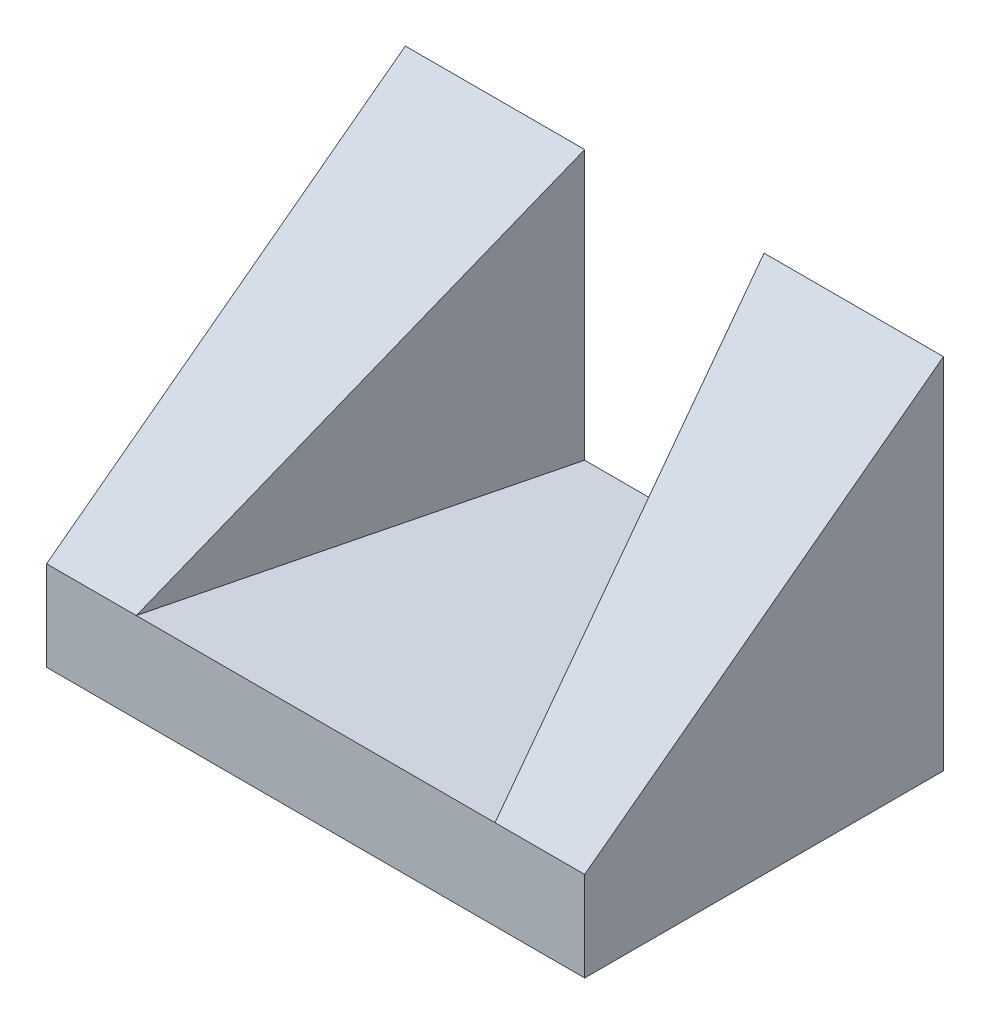
ISO-10303-21;
HEADER;
FILE_DESCRIPTION(('STEP AP214'),'2;1');
FILE_NAME('part.step','',(''),(''),'','','');
FILE_SCHEMA(('AUTOMOTIVE_DESIGN { 1 0 10303 214 1 1 1 1 }'));
ENDSEC;
DATA;
#1=APPLICATION_CONTEXT('core data for automotive mechanical design processes');
#2=APPLICATION_PROTOCOL_DEFINITION('international standard','automotive_design',2000,#1);
#3=PRODUCT_CONTEXT('',#1,'mechanical');
#4=PRODUCT('Part','Part','',(#3));
#5=PRODUCT_RELATED_PRODUCT_CATEGORY('part','',(#4));
#6=PRODUCT_DEFINITION_FORMATION('','',#4);
#7=PRODUCT_DEFINITION_CONTEXT('part definition',#1,'design');
#8=PRODUCT_DEFINITION('design','',#6,#7);
#9=PRODUCT_DEFINITION_SHAPE('','',#8);
#10=(LENGTH_UNIT() NAMED_UNIT(*) SI_UNIT(.MILLI.,.METRE.));
#11=(NAMED_UNIT(*) PLANE_ANGLE_UNIT() SI_UNIT($,.RADIAN.));
#12=(NAMED_UNIT(*) SI_UNIT($,.STERADIAN.) SOLID_ANGLE_UNIT());
#13=UNCERTAINTY_MEASURE_WITH_UNIT(LENGTH_MEASURE(1.E-05),#10,'distance_accuracy_value','');
#14=(GEOMETRIC_REPRESENTATION_CONTEXT(3) GLOBAL_UNCERTAINTY_ASSIGNED_CONTEXT((#13)) GLOBAL_UNIT_ASSIGNED_CONTEXT((#10,
#11,#12)) REPRESENTATION_CONTEXT('',''));
#15=CARTESIAN_POINT('',(0.,0.,0.));
#16=DIRECTION('',(0.,0.,1.));
#17=DIRECTION('',(1.,0.,0.));
#18=AXIS2_PLACEMENT_3D('',#15,#16,#17);
#19=CARTESIAN_POINT('',(0.,10.,0.));
#20=DIRECTION('',(1.,0.,0.));
#21=DIRECTION('',(0.,0.,-1.));
#22=AXIS2_PLACEMENT_3D('',#19,#20,#21);
#23=PLANE('',#22);
#24=DIRECTION('',(0.,-0.6,0.8));
#25=VECTOR('',#24,1.);
#26=CARTESIAN_POINT('',(0.,10.,0.));
#27=LINE('',#26,#25);
#28=CARTESIAN_POINT('',(0.,40.,-40.));
#29=VERTEX_POINT('',#28);
#30=CARTESIAN_POINT('',(0.,10.,0.));
#31=VERTEX_POINT('',#30);
#32=EDGE_CURVE('E116',#29,#31,#27,.T.);
#33=ORIENTED_EDGE('',*,*,#32,.F.);
#34=DIRECTION('',(0.,-1.,0.));
#35=VECTOR('',#34,1.);
#36=CARTESIAN_POINT('',(0.,10.,-40.));
#37=LINE('',#36,#35);
#38=CARTESIAN_POINT('',(0.,0.,-40.));
#39=VERTEX_POINT('',#38);
#40=EDGE_CURVE('E125',#29,#39,#37,.T.);
#41=ORIENTED_EDGE('',*,*,#40,.T.);
#42=DIRECTION('',(0.,0.,1.));
#43=VECTOR('',#42,1.);
#44=CARTESIAN_POINT('',(0.,0.,0.));
#45=LINE('',#44,#43);
#46=CARTESIAN_POINT('',(0.,0.,0.));
#47=VERTEX_POINT('',#46);
#48=EDGE_CURVE('E138',#39,#47,#45,.T.);
#49=ORIENTED_EDGE('',*,*,#48,.T.);
#50=DIRECTION('',(0.,-1.,0.));
#51=VECTOR('',#50,1.);
#52=CARTESIAN_POINT('',(0.,10.,0.));
#53=LINE('',#52,#51);
#54=EDGE_CURVE('E11',#31,#47,#53,.T.);
#55=ORIENTED_EDGE('',*,*,#54,.F.);
#56=EDGE_LOOP('',(#33,#41,#49,#55));
#57=FACE_BOUND('',#56,.T.);
#58=ADVANCED_FACE('F39',(#57),#23,.F.);
#59=CARTESIAN_POINT('',(0.,10.,0.));
#60=DIRECTION('',(0.,0.,-1.));
#61=DIRECTION('',(-1.,0.,0.));
#62=AXIS2_PLACEMENT_3D('',#59,#60,#61);
#63=PLANE('',#62);
#64=DIRECTION('',(-1.,0.,0.));
#65=VECTOR('',#64,1.);
#66=CARTESIAN_POINT('',(69.,10.,0.));
#67=LINE('',#66,#65);
#68=CARTESIAN_POINT('',(10.,10.,0.));
#69=VERTEX_POINT('',#68);
#70=EDGE_CURVE('E109',#69,#31,#67,.T.);
#71=ORIENTED_EDGE('',*,*,#70,.T.);
#72=ORIENTED_EDGE('',*,*,#54,.T.);
#73=DIRECTION('',(1.,0.,0.));
#74=VECTOR('',#73,1.);
#75=CARTESIAN_POINT('',(0.,0.,0.));
#76=LINE('',#75,#74);
#77=CARTESIAN_POINT('',(60.,0.,0.));
#78=VERTEX_POINT('',#77);
#79=EDGE_CURVE('E122',#47,#78,#76,.T.);
#80=ORIENTED_EDGE('',*,*,#79,.T.);
#81=DIRECTION('',(0.,-1.,0.));
#82=VECTOR('',#81,1.);
#83=CARTESIAN_POINT('',(60.,10.,0.));
#84=LINE('',#83,#82);
#85=CARTESIAN_POINT('',(60.,10.,0.));
#86=VERTEX_POINT('',#85);
#87=EDGE_CURVE('E47',#86,#78,#84,.T.);
#88=ORIENTED_EDGE('',*,*,#87,.F.);
#89=CARTESIAN_POINT('',(50.,10.,0.));
#90=VERTEX_POINT('',#89);
#91=EDGE_CURVE('E98',#86,#90,#67,.T.);
#92=ORIENTED_EDGE('',*,*,#91,.T.);
#93=DIRECTION('',(1.,0.,0.));
#94=VECTOR('',#93,1.);
#95=CARTESIAN_POINT('',(0.,10.,0.));
#96=LINE('',#95,#94);
#97=EDGE_CURVE('E133',#69,#90,#96,.T.);
#98=ORIENTED_EDGE('',*,*,#97,.F.);
#99=EDGE_LOOP('',(#71,#72,#80,#88,#92,#98));
#100=FACE_BOUND('',#99,.T.);
#101=ADVANCED_FACE('F120',(#100),#63,.F.);
#102=CARTESIAN_POINT('',(60.,10.,0.));
#103=DIRECTION('',(-1.,0.,0.));
#104=DIRECTION('',(0.,0.,1.));
#105=AXIS2_PLACEMENT_3D('',#102,#103,#104);
#106=PLANE('',#105);
#107=DIRECTION('',(0.,0.6,-0.8));
#108=VECTOR('',#107,1.);
#109=CARTESIAN_POINT('',(60.,10.,0.));
#110=LINE('',#109,#108);
#111=CARTESIAN_POINT('',(60.,40.,-40.));
#112=VERTEX_POINT('',#111);
#113=EDGE_CURVE('E101',#86,#112,#110,.T.);
#114=ORIENTED_EDGE('',*,*,#113,.F.);
#115=ORIENTED_EDGE('',*,*,#87,.T.);
#116=DIRECTION('',(0.,0.,-1.));
#117=VECTOR('',#116,1.);
#118=CARTESIAN_POINT('',(60.,0.,0.));
#119=LINE('',#118,#117);
#120=CARTESIAN_POINT('',(60.,0.,-40.));
#121=VERTEX_POINT('',#120);
#122=EDGE_CURVE('E62',#78,#121,#119,.T.);
#123=ORIENTED_EDGE('',*,*,#122,.T.);
#124=DIRECTION('',(0.,-1.,0.));
#125=VECTOR('',#124,1.);
#126=CARTESIAN_POINT('',(60.,10.,-40.));
#127=LINE('',#126,#125);
#128=EDGE_CURVE('E113',#112,#121,#127,.T.);
#129=ORIENTED_EDGE('',*,*,#128,.F.);
#130=EDGE_LOOP('',(#114,#115,#123,#129));
#131=FACE_BOUND('',#130,.T.);
#132=ADVANCED_FACE('F111',(#131),#106,.F.);
#133=CARTESIAN_POINT('',(20.,40.,-40.));
#134=DIRECTION('',(-0.970142500145332,0.,-0.242535625036333));
#135=DIRECTION('',(-0.242535625036333,0.,0.970142500145332));
#136=AXIS2_PLACEMENT_3D('',#133,#134,#135);
#137=PLANE('',#136);
#138=DIRECTION('',(0.196116135138184,0.588348405414552,-0.784464540552736));
#139=VECTOR('',#138,1.);
#140=CARTESIAN_POINT('',(20.,40.,-40.));
#141=LINE('',#140,#139);
#142=CARTESIAN_POINT('',(20.,40.,-40.));
#143=VERTEX_POINT('',#142);
#144=EDGE_CURVE('E117',#69,#143,#141,.T.);
#145=ORIENTED_EDGE('',*,*,#144,.F.);
#146=DIRECTION('',(0.242535625036333,0.,-0.970142500145332));
#147=VECTOR('',#146,1.);
#148=CARTESIAN_POINT('',(20.,10.,-40.));
#149=LINE('',#148,#147);
#150=CARTESIAN_POINT('',(20.,10.,-40.));
#151=VERTEX_POINT('',#150);
#152=EDGE_CURVE('E151',#69,#151,#149,.T.);
#153=ORIENTED_EDGE('',*,*,#152,.T.);
#154=DIRECTION('',(0.,-1.,0.));
#155=VECTOR('',#154,1.);
#156=CARTESIAN_POINT('',(20.,40.,-40.));
#157=LINE('',#156,#155);
#158=EDGE_CURVE('E142',#143,#151,#157,.T.);
#159=ORIENTED_EDGE('',*,*,#158,.F.);
#160=EDGE_LOOP('',(#145,#153,#159));
#161=FACE_BOUND('',#160,.T.);
#162=ADVANCED_FACE('F201',(#161),#137,.F.);
#163=CARTESIAN_POINT('',(40.,40.,-40.));
#164=DIRECTION('',(0.970142500145332,0.,-0.242535625036333));
#165=DIRECTION('',(-0.242535625036333,0.,-0.970142500145332));
#166=AXIS2_PLACEMENT_3D('',#163,#164,#165);
#167=PLANE('',#166);
#168=DIRECTION('',(0.196116135138184,-0.588348405414552,0.784464540552736));
#169=VECTOR('',#168,1.);
#170=CARTESIAN_POINT('',(40.,40.,-40.));
#171=LINE('',#170,#169);
#172=CARTESIAN_POINT('',(40.,40.,-40.));
#173=VERTEX_POINT('',#172);
#174=EDGE_CURVE('E103',#173,#90,#171,.T.);
#175=ORIENTED_EDGE('',*,*,#174,.F.);
#176=DIRECTION('',(0.,-1.,0.));
#177=VECTOR('',#176,1.);
#178=CARTESIAN_POINT('',(40.,40.,-40.));
#179=LINE('',#178,#177);
#180=CARTESIAN_POINT('',(40.,10.,-40.));
#181=VERTEX_POINT('',#180);
#182=EDGE_CURVE('E155',#173,#181,#179,.T.);
#183=ORIENTED_EDGE('',*,*,#182,.T.);
#184=DIRECTION('',(0.242535625036333,0.,0.970142500145332));
#185=VECTOR('',#184,1.);
#186=CARTESIAN_POINT('',(40.,10.,-40.));
#187=LINE('',#186,#185);
#188=EDGE_CURVE('E162',#181,#90,#187,.T.);
#189=ORIENTED_EDGE('',*,*,#188,.T.);
#190=EDGE_LOOP('',(#175,#183,#189));
#191=FACE_BOUND('',#190,.T.);
#192=ADVANCED_FACE('F206',(#191),#167,.F.);
#193=CARTESIAN_POINT('',(0.,10.,0.));
#194=DIRECTION('',(0.,-1.,0.));
#195=DIRECTION('',(0.,0.,-1.));
#196=AXIS2_PLACEMENT_3D('',#193,#194,#195);
#197=PLANE('',#196);
#198=ORIENTED_EDGE('',*,*,#188,.F.);
#199=DIRECTION('',(-1.,0.,0.));
#200=VECTOR('',#199,1.);
#201=CARTESIAN_POINT('',(0.,10.,-40.));
#202=LINE('',#201,#200);
#203=EDGE_CURVE('E130',#181,#151,#202,.T.);
#204=ORIENTED_EDGE('',*,*,#203,.T.);
#205=ORIENTED_EDGE('',*,*,#152,.F.);
#206=ORIENTED_EDGE('',*,*,#97,.T.);
#207=EDGE_LOOP('',(#198,#204,#205,#206));
#208=FACE_BOUND('',#207,.T.);
#209=ADVANCED_FACE('F191',(#208),#197,.F.);
#210=CARTESIAN_POINT('',(0.,10.,-40.));
#211=DIRECTION('',(0.,0.,1.));
#212=DIRECTION('',(1.,0.,0.));
#213=AXIS2_PLACEMENT_3D('',#210,#211,#212);
#214=PLANE('',#213);
#215=DIRECTION('',(-1.,0.,0.));
#216=VECTOR('',#215,1.);
#217=CARTESIAN_POINT('',(0.,0.,-40.));
#218=LINE('',#217,#216);
#219=EDGE_CURVE('E54',#121,#39,#218,.T.);
#220=ORIENTED_EDGE('',*,*,#219,.T.);
#221=ORIENTED_EDGE('',*,*,#40,.F.);
#222=DIRECTION('',(-1.,0.,0.));
#223=VECTOR('',#222,1.);
#224=CARTESIAN_POINT('',(0.,40.,-40.));
#225=LINE('',#224,#223);
#226=EDGE_CURVE('E150',#143,#29,#225,.T.);
#227=ORIENTED_EDGE('',*,*,#226,.F.);
#228=ORIENTED_EDGE('',*,*,#158,.T.);
#229=ORIENTED_EDGE('',*,*,#203,.F.);
#230=ORIENTED_EDGE('',*,*,#182,.F.);
#231=DIRECTION('',(-1.,0.,0.));
#232=VECTOR('',#231,1.);
#233=CARTESIAN_POINT('',(60.,40.,-40.));
#234=LINE('',#233,#232);
#235=EDGE_CURVE('E161',#112,#173,#234,.T.);
#236=ORIENTED_EDGE('',*,*,#235,.F.);
#237=ORIENTED_EDGE('',*,*,#128,.T.);
#238=EDGE_LOOP('',(#220,#221,#227,#228,#229,#230,#236,#237));
#239=FACE_BOUND('',#238,.T.);
#240=ADVANCED_FACE('F183',(#239),#214,.F.);
#241=CARTESIAN_POINT('',(0.,0.,0.));
#242=DIRECTION('',(0.,-1.,0.));
#243=DIRECTION('',(0.,0.,-1.));
#244=AXIS2_PLACEMENT_3D('',#241,#242,#243);
#245=PLANE('',#244);
#246=ORIENTED_EDGE('',*,*,#48,.F.);
#247=ORIENTED_EDGE('',*,*,#219,.F.);
#248=ORIENTED_EDGE('',*,*,#122,.F.);
#249=ORIENTED_EDGE('',*,*,#79,.F.);
#250=EDGE_LOOP('',(#246,#247,#248,#249));
#251=FACE_BOUND('',#250,.T.);
#252=ADVANCED_FACE('F181',(#251),#245,.T.);
#253=CARTESIAN_POINT('',(69.,6.4,4.79999999999998));
#254=DIRECTION('',(0.,0.8,0.6));
#255=DIRECTION('',(0.,-0.6,0.8));
#256=AXIS2_PLACEMENT_3D('',#253,#254,#255);
#257=PLANE('',#256);
#258=ORIENTED_EDGE('',*,*,#113,.T.);
#259=ORIENTED_EDGE('',*,*,#235,.T.);
#260=ORIENTED_EDGE('',*,*,#174,.T.);
#261=ORIENTED_EDGE('',*,*,#91,.F.);
#262=EDGE_LOOP('',(#258,#259,#260,#261));
#263=FACE_BOUND('',#262,.T.);
#264=ADVANCED_FACE('F100',(#263),#257,.T.);
#265=ORIENTED_EDGE('',*,*,#32,.T.);
#266=ORIENTED_EDGE('',*,*,#70,.F.);
#267=ORIENTED_EDGE('',*,*,#144,.T.);
#268=ORIENTED_EDGE('',*,*,#226,.T.);
#269=EDGE_LOOP('',(#265,#266,#267,#268));
#270=FACE_BOUND('',#269,.T.);
#271=ADVANCED_FACE('F189',(#270),#257,.T.);
#272=CLOSED_SHELL('',(#58,#101,#132,#162,#192,#209,#240,#252,#264,#271));
#273=MANIFOLD_SOLID_BREP('B2',#272);
#274=ADVANCED_BREP_SHAPE_REPRESENTATION('',(#18,#273),#14);
#275=SHAPE_DEFINITION_REPRESENTATION(#9,#274);
ENDSEC;
END-ISO-10303-21;
